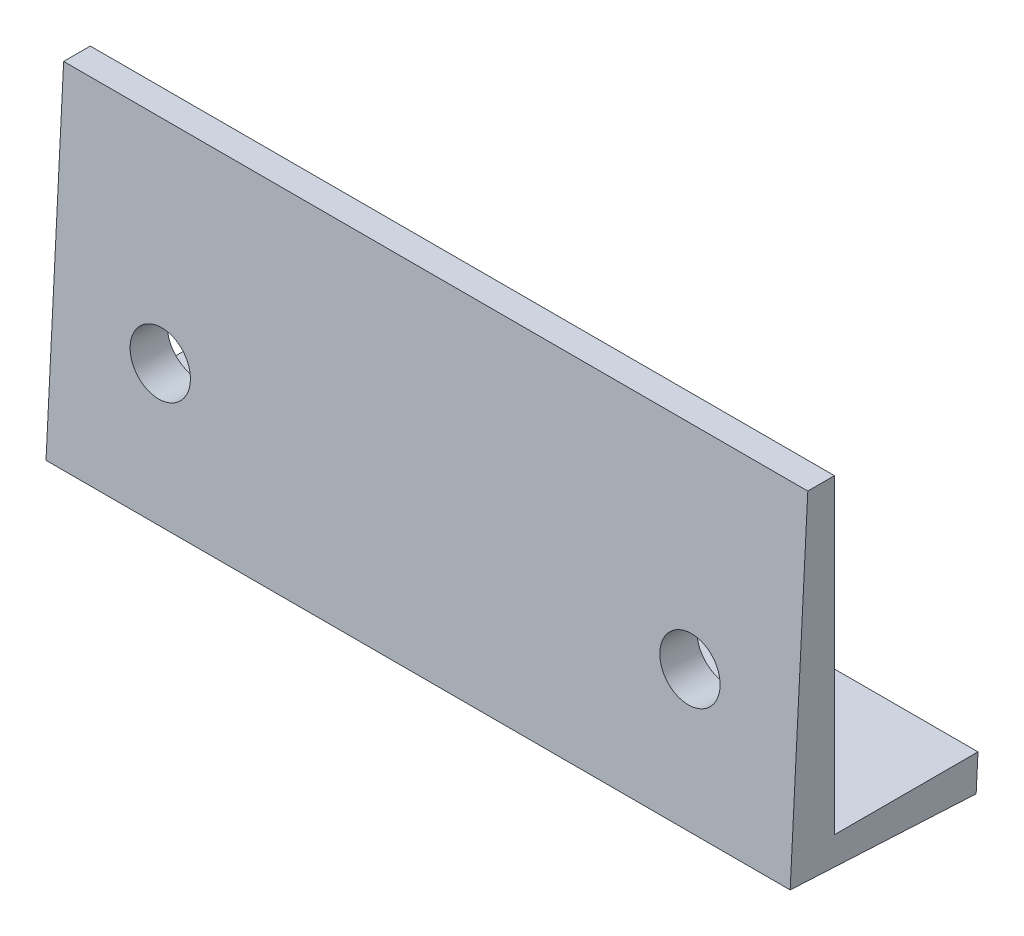
ISO-10303-21;
HEADER;
FILE_DESCRIPTION(('STEP AP214'),'2;1');
FILE_NAME('part.step','',(''),(''),'','','');
FILE_SCHEMA(('AUTOMOTIVE_DESIGN { 1 0 10303 214 1 1 1 1 }'));
ENDSEC;
DATA;
#1=APPLICATION_CONTEXT('core data for automotive mechanical design processes');
#2=APPLICATION_PROTOCOL_DEFINITION('international standard','automotive_design',2000,#1);
#3=PRODUCT_CONTEXT('',#1,'mechanical');
#4=PRODUCT('Part','Part','',(#3));
#5=PRODUCT_RELATED_PRODUCT_CATEGORY('part','',(#4));
#6=PRODUCT_DEFINITION_FORMATION('','',#4);
#7=PRODUCT_DEFINITION_CONTEXT('part definition',#1,'design');
#8=PRODUCT_DEFINITION('design','',#6,#7);
#9=PRODUCT_DEFINITION_SHAPE('','',#8);
#10=(LENGTH_UNIT() NAMED_UNIT(*) SI_UNIT(.MILLI.,.METRE.));
#11=(NAMED_UNIT(*) PLANE_ANGLE_UNIT() SI_UNIT($,.RADIAN.));
#12=(NAMED_UNIT(*) SI_UNIT($,.STERADIAN.) SOLID_ANGLE_UNIT());
#13=UNCERTAINTY_MEASURE_WITH_UNIT(LENGTH_MEASURE(1.E-05),#10,'distance_accuracy_value','');
#14=(GEOMETRIC_REPRESENTATION_CONTEXT(3) GLOBAL_UNCERTAINTY_ASSIGNED_CONTEXT((#13)) GLOBAL_UNIT_ASSIGNED_CONTEXT((#10,
#11,#12)) REPRESENTATION_CONTEXT('',''));
#15=CARTESIAN_POINT('',(0.,0.,0.));
#16=DIRECTION('',(0.,0.,1.));
#17=DIRECTION('',(1.,0.,0.));
#18=AXIS2_PLACEMENT_3D('',#15,#16,#17);
#19=CARTESIAN_POINT('',(42.,-19.,5.));
#20=DIRECTION('',(-1.,0.,0.));
#21=DIRECTION('',(0.,0.,1.));
#22=AXIS2_PLACEMENT_3D('',#19,#20,#21);
#23=PLANE('',#22);
#24=DIRECTION('',(0.,0.0523359562429439,0.998629534754574));
#25=VECTOR('',#24,1.);
#26=CARTESIAN_POINT('',(42.,-19.2616797812147,0.00685232622713093));
#27=LINE('',#26,#25);
#28=CARTESIAN_POINT('',(42.,-20.1002042497434,-15.9931476737729));
#29=VERTEX_POINT('',#28);
#30=CARTESIAN_POINT('',(42.,-19.,5.));
#31=VERTEX_POINT('',#30);
#32=EDGE_CURVE('E110',#29,#31,#27,.T.);
#33=ORIENTED_EDGE('',*,*,#32,.F.);
#34=DIRECTION('',(0.,-0.998629534754574,0.0523359562429444));
#35=VECTOR('',#34,1.);
#36=CARTESIAN_POINT('',(42.,-20.1002042497434,-15.9931476737729));
#37=LINE('',#36,#35);
#38=CARTESIAN_POINT('',(42.,-16.1002042497434,-16.202778790905));
#39=VERTEX_POINT('',#38);
#40=EDGE_CURVE('E100',#39,#29,#37,.T.);
#41=ORIENTED_EDGE('',*,*,#40,.F.);
#42=DIRECTION('',(0.,0.,-1.));
#43=VECTOR('',#42,1.);
#44=CARTESIAN_POINT('',(42.,-16.1002042497434,-16.202778790905));
#45=LINE('',#44,#43);
#46=CARTESIAN_POINT('',(42.,-16.1002042497434,0.));
#47=VERTEX_POINT('',#46);
#48=EDGE_CURVE('E108',#47,#39,#45,.T.);
#49=ORIENTED_EDGE('',*,*,#48,.F.);
#50=DIRECTION('',(0.,1.,0.));
#51=VECTOR('',#50,1.);
#52=CARTESIAN_POINT('',(42.,-19.,0.));
#53=LINE('',#52,#51);
#54=CARTESIAN_POINT('',(42.,19.,0.));
#55=VERTEX_POINT('',#54);
#56=EDGE_CURVE('E66',#47,#55,#53,.T.);
#57=ORIENTED_EDGE('',*,*,#56,.T.);
#58=DIRECTION('',(0.,0.,-1.));
#59=VECTOR('',#58,1.);
#60=CARTESIAN_POINT('',(42.,19.,5.));
#61=LINE('',#60,#59);
#62=CARTESIAN_POINT('',(42.,19.,3.00850438724443));
#63=VERTEX_POINT('',#62);
#64=EDGE_CURVE('E11',#63,#55,#61,.T.);
#65=ORIENTED_EDGE('',*,*,#64,.F.);
#66=DIRECTION('',(0.,0.998629534754574,-0.0523359562429439));
#67=VECTOR('',#66,1.);
#68=CARTESIAN_POINT('',(42.,-19.,5.));
#69=LINE('',#68,#67);
#70=EDGE_CURVE('E70',#31,#63,#69,.T.);
#71=ORIENTED_EDGE('',*,*,#70,.F.);
#72=EDGE_LOOP('',(#33,#41,#49,#57,#65,#71));
#73=FACE_BOUND('',#72,.T.);
#74=ADVANCED_FACE('F39',(#73),#23,.F.);
#75=CARTESIAN_POINT('',(-42.,19.,5.));
#76=DIRECTION('',(0.,-1.,0.));
#77=DIRECTION('',(0.,0.,-1.));
#78=AXIS2_PLACEMENT_3D('',#75,#76,#77);
#79=PLANE('',#78);
#80=DIRECTION('',(0.,0.,-1.));
#81=VECTOR('',#80,1.);
#82=CARTESIAN_POINT('',(-42.,19.,5.));
#83=LINE('',#82,#81);
#84=CARTESIAN_POINT('',(-42.,19.,3.00850438724443));
#85=VERTEX_POINT('',#84);
#86=CARTESIAN_POINT('',(-42.,19.,0.));
#87=VERTEX_POINT('',#86);
#88=EDGE_CURVE('E47',#85,#87,#83,.T.);
#89=ORIENTED_EDGE('',*,*,#88,.F.);
#90=DIRECTION('',(1.,0.,0.));
#91=VECTOR('',#90,1.);
#92=CARTESIAN_POINT('',(-42.,19.,3.00850438724443));
#93=LINE('',#92,#91);
#94=EDGE_CURVE('E73',#85,#63,#93,.T.);
#95=ORIENTED_EDGE('',*,*,#94,.T.);
#96=ORIENTED_EDGE('',*,*,#64,.T.);
#97=DIRECTION('',(-1.,0.,0.));
#98=VECTOR('',#97,1.);
#99=CARTESIAN_POINT('',(-42.,19.,0.));
#100=LINE('',#99,#98);
#101=EDGE_CURVE('E136',#55,#87,#100,.T.);
#102=ORIENTED_EDGE('',*,*,#101,.T.);
#103=EDGE_LOOP('',(#89,#95,#96,#102));
#104=FACE_BOUND('',#103,.T.);
#105=ADVANCED_FACE('F147',(#104),#79,.F.);
#106=CARTESIAN_POINT('',(-42.,-19.,5.));
#107=DIRECTION('',(1.,0.,0.));
#108=DIRECTION('',(0.,0.,-1.));
#109=AXIS2_PLACEMENT_3D('',#106,#107,#108);
#110=PLANE('',#109);
#111=DIRECTION('',(0.,-1.,0.));
#112=VECTOR('',#111,1.);
#113=CARTESIAN_POINT('',(-42.,-19.,0.));
#114=LINE('',#113,#112);
#115=CARTESIAN_POINT('',(-42.,-16.1002042497434,0.));
#116=VERTEX_POINT('',#115);
#117=EDGE_CURVE('E134',#87,#116,#114,.T.);
#118=ORIENTED_EDGE('',*,*,#117,.T.);
#119=DIRECTION('',(0.,0.,-1.));
#120=VECTOR('',#119,1.);
#121=CARTESIAN_POINT('',(-42.,-16.1002042497434,-16.202778790905));
#122=LINE('',#121,#120);
#123=CARTESIAN_POINT('',(-42.,-16.1002042497434,-16.202778790905));
#124=VERTEX_POINT('',#123);
#125=EDGE_CURVE('E117',#116,#124,#122,.T.);
#126=ORIENTED_EDGE('',*,*,#125,.T.);
#127=DIRECTION('',(0.,-0.998629534754574,0.0523359562429444));
#128=VECTOR('',#127,1.);
#129=CARTESIAN_POINT('',(-42.,-20.1002042497434,-15.9931476737729));
#130=LINE('',#129,#128);
#131=CARTESIAN_POINT('',(-42.,-20.1002042497434,-15.9931476737729));
#132=VERTEX_POINT('',#131);
#133=EDGE_CURVE('E102',#124,#132,#130,.T.);
#134=ORIENTED_EDGE('',*,*,#133,.T.);
#135=DIRECTION('',(0.,-0.0523359562429439,-0.998629534754574));
#136=VECTOR('',#135,1.);
#137=CARTESIAN_POINT('',(-42.,-19.2616797812147,0.00685232622713093));
#138=LINE('',#137,#136);
#139=CARTESIAN_POINT('',(-42.,-19.,5.));
#140=VERTEX_POINT('',#139);
#141=EDGE_CURVE('E125',#140,#132,#138,.T.);
#142=ORIENTED_EDGE('',*,*,#141,.F.);
#143=DIRECTION('',(0.,-0.998629534754574,0.0523359562429439));
#144=VECTOR('',#143,1.);
#145=CARTESIAN_POINT('',(-42.,-19.,5.));
#146=LINE('',#145,#144);
#147=EDGE_CURVE('E54',#85,#140,#146,.T.);
#148=ORIENTED_EDGE('',*,*,#147,.F.);
#149=ORIENTED_EDGE('',*,*,#88,.T.);
#150=EDGE_LOOP('',(#118,#126,#134,#142,#148,#149));
#151=FACE_BOUND('',#150,.T.);
#152=ADVANCED_FACE('F142',(#151),#110,.F.);
#153=CARTESIAN_POINT('',(0.,0.,0.));
#154=DIRECTION('',(0.,0.,-1.));
#155=DIRECTION('',(-1.,0.,0.));
#156=AXIS2_PLACEMENT_3D('',#153,#154,#155);
#157=PLANE('',#156);
#158=CARTESIAN_POINT('',(-29.8956518577535,-4.08909575725117,0.));
#159=DIRECTION('',(0.,0.,-1.));
#160=DIRECTION('',(0.,1.,0.));
#161=AXIS2_PLACEMENT_3D('',#158,#159,#160);
#162=ELLIPSE('',#161,3.40466597639305,3.40000000000012);
#163=CARTESIAN_POINT('',(-29.8956518577535,-0.684429780858121,0.));
#164=VERTEX_POINT('',#163);
#165=EDGE_CURVE('E120',#164,#164,#162,.T.);
#166=ORIENTED_EDGE('',*,*,#165,.F.);
#167=EDGE_LOOP('',(#166));
#168=FACE_BOUND('',#167,.T.);
#169=CARTESIAN_POINT('',(29.8956518577535,-4.08909575725117,0.));
#170=DIRECTION('',(0.,0.,-1.));
#171=DIRECTION('',(0.,1.,0.));
#172=AXIS2_PLACEMENT_3D('',#169,#170,#171);
#173=ELLIPSE('',#172,3.40466597639305,3.40000000000012);
#174=CARTESIAN_POINT('',(29.8956518577535,-0.684429780858118,0.));
#175=VERTEX_POINT('',#174);
#176=EDGE_CURVE('E257',#175,#175,#173,.T.);
#177=ORIENTED_EDGE('',*,*,#176,.F.);
#178=EDGE_LOOP('',(#177));
#179=FACE_BOUND('',#178,.T.);
#180=DIRECTION('',(-1.,0.,0.));
#181=VECTOR('',#180,1.);
#182=CARTESIAN_POINT('',(42.,-16.1002042497434,0.));
#183=LINE('',#182,#181);
#184=EDGE_CURVE('E115',#47,#116,#183,.T.);
#185=ORIENTED_EDGE('',*,*,#184,.T.);
#186=ORIENTED_EDGE('',*,*,#117,.F.);
#187=ORIENTED_EDGE('',*,*,#101,.F.);
#188=ORIENTED_EDGE('',*,*,#56,.F.);
#189=EDGE_LOOP('',(#185,#186,#187,#188));
#190=FACE_BOUND('',#189,.T.);
#191=ADVANCED_FACE('F149',(#168,#179,#190),#157,.T.);
#192=CARTESIAN_POINT('',(0.,-0.0260388396630972,4.00561683138406));
#193=DIRECTION('',(0.,-0.0523359562429439,-0.998629534754574));
#194=DIRECTION('',(-1.,0.,0.));
#195=AXIS2_PLACEMENT_3D('',#192,#193,#194);
#196=PLANE('',#195);
#197=CARTESIAN_POINT('',(-29.8956518577535,-3.86861634587975,4.20699778520785));
#198=DIRECTION('',(0.,0.052335956242944,0.998629534754574));
#199=DIRECTION('',(0.,-0.998629534754574,0.052335956242944));
#200=AXIS2_PLACEMENT_3D('',#197,#198,#199);
#201=CIRCLE('',#200,3.40000000000012);
#202=CARTESIAN_POINT('',(-29.8956518577535,-7.26395676404542,4.38494003643387));
#203=VERTEX_POINT('',#202);
#204=EDGE_CURVE('E256',#203,#203,#201,.T.);
#205=ORIENTED_EDGE('',*,*,#204,.F.);
#206=EDGE_LOOP('',(#205));
#207=FACE_BOUND('',#206,.T.);
#208=CARTESIAN_POINT('',(29.8956518577535,-3.86861634587975,4.20699778520785));
#209=DIRECTION('',(0.,0.052335956242944,0.998629534754574));
#210=DIRECTION('',(0.,-0.998629534754574,0.052335956242944));
#211=AXIS2_PLACEMENT_3D('',#208,#209,#210);
#212=CIRCLE('',#211,3.40000000000012);
#213=CARTESIAN_POINT('',(29.8956518577535,-7.26395676404543,4.38494003643387));
#214=VERTEX_POINT('',#213);
#215=EDGE_CURVE('E258',#214,#214,#212,.T.);
#216=ORIENTED_EDGE('',*,*,#215,.F.);
#217=EDGE_LOOP('',(#216));
#218=FACE_BOUND('',#217,.T.);
#219=ORIENTED_EDGE('',*,*,#147,.T.);
#220=DIRECTION('',(1.,0.,0.));
#221=VECTOR('',#220,1.);
#222=CARTESIAN_POINT('',(-42.,-19.,5.));
#223=LINE('',#222,#221);
#224=EDGE_CURVE('E132',#140,#31,#223,.T.);
#225=ORIENTED_EDGE('',*,*,#224,.T.);
#226=ORIENTED_EDGE('',*,*,#70,.T.);
#227=ORIENTED_EDGE('',*,*,#94,.F.);
#228=EDGE_LOOP('',(#219,#225,#226,#227));
#229=FACE_BOUND('',#228,.T.);
#230=ADVANCED_FACE('F151',(#207,#218,#229),#196,.F.);
#231=CARTESIAN_POINT('',(0.,-19.2616797812147,0.00685232622713093));
#232=DIRECTION('',(0.,0.998629534754574,-0.0523359562429439));
#233=DIRECTION('',(0.,0.0523359562429439,0.998629534754574));
#234=AXIS2_PLACEMENT_3D('',#231,#232,#233);
#235=PLANE('',#234);
#236=ORIENTED_EDGE('',*,*,#141,.T.);
#237=DIRECTION('',(-1.,0.,0.));
#238=VECTOR('',#237,1.);
#239=CARTESIAN_POINT('',(42.,-20.1002042497434,-15.9931476737729));
#240=LINE('',#239,#238);
#241=EDGE_CURVE('E106',#29,#132,#240,.T.);
#242=ORIENTED_EDGE('',*,*,#241,.F.);
#243=ORIENTED_EDGE('',*,*,#32,.T.);
#244=ORIENTED_EDGE('',*,*,#224,.F.);
#245=EDGE_LOOP('',(#236,#242,#243,#244));
#246=FACE_BOUND('',#245,.T.);
#247=ADVANCED_FACE('F158',(#246),#235,.F.);
#248=CARTESIAN_POINT('',(42.,-16.1002042497434,-16.202778790905));
#249=DIRECTION('',(0.,1.,0.));
#250=DIRECTION('',(0.,0.,1.));
#251=AXIS2_PLACEMENT_3D('',#248,#249,#250);
#252=PLANE('',#251);
#253=ORIENTED_EDGE('',*,*,#125,.F.);
#254=ORIENTED_EDGE('',*,*,#184,.F.);
#255=ORIENTED_EDGE('',*,*,#48,.T.);
#256=DIRECTION('',(-1.,0.,0.));
#257=VECTOR('',#256,1.);
#258=CARTESIAN_POINT('',(42.,-16.1002042497434,-16.202778790905));
#259=LINE('',#258,#257);
#260=EDGE_CURVE('E96',#39,#124,#259,.T.);
#261=ORIENTED_EDGE('',*,*,#260,.T.);
#262=EDGE_LOOP('',(#253,#254,#255,#261));
#263=FACE_BOUND('',#262,.T.);
#264=ADVANCED_FACE('F113',(#263),#252,.T.);
#265=CARTESIAN_POINT('',(42.,-20.1002042497434,-15.9931476737729));
#266=DIRECTION('',(0.,-0.0523359562429444,-0.998629534754574));
#267=DIRECTION('',(0.,0.998629534754574,-0.0523359562429444));
#268=AXIS2_PLACEMENT_3D('',#265,#266,#267);
#269=PLANE('',#268);
#270=ORIENTED_EDGE('',*,*,#133,.F.);
#271=ORIENTED_EDGE('',*,*,#260,.F.);
#272=ORIENTED_EDGE('',*,*,#40,.T.);
#273=ORIENTED_EDGE('',*,*,#241,.T.);
#274=EDGE_LOOP('',(#270,#271,#272,#273));
#275=FACE_BOUND('',#274,.T.);
#276=ADVANCED_FACE('F98',(#275),#269,.T.);
#277=CARTESIAN_POINT('',(29.8956518577535,-4.39197590830919,-5.77929756233789));
#278=DIRECTION('',(0.,0.052335956242944,0.998629534754574));
#279=DIRECTION('',(0.,-0.998629534754574,0.052335956242944));
#280=AXIS2_PLACEMENT_3D('',#277,#278,#279);
#281=CYLINDRICAL_SURFACE('',#280,3.40000000000012);
#282=ORIENTED_EDGE('',*,*,#176,.T.);
#283=EDGE_LOOP('',(#282));
#284=FACE_BOUND('',#283,.T.);
#285=ORIENTED_EDGE('',*,*,#215,.T.);
#286=EDGE_LOOP('',(#285));
#287=FACE_BOUND('',#286,.T.);
#288=ADVANCED_FACE('F231',(#284,#287),#281,.F.);
#289=CARTESIAN_POINT('',(-29.8956518577535,-4.39197590830919,-5.77929756233789));
#290=DIRECTION('',(0.,0.052335956242944,0.998629534754574));
#291=DIRECTION('',(0.,-0.998629534754574,0.052335956242944));
#292=AXIS2_PLACEMENT_3D('',#289,#290,#291);
#293=CYLINDRICAL_SURFACE('',#292,3.40000000000012);
#294=ORIENTED_EDGE('',*,*,#165,.T.);
#295=EDGE_LOOP('',(#294));
#296=FACE_BOUND('',#295,.T.);
#297=ORIENTED_EDGE('',*,*,#204,.T.);
#298=EDGE_LOOP('',(#297));
#299=FACE_BOUND('',#298,.T.);
#300=ADVANCED_FACE('F239',(#296,#299),#293,.F.);
#301=CLOSED_SHELL('',(#74,#105,#152,#191,#230,#247,#264,#276,#288,#300));
#302=MANIFOLD_SOLID_BREP('B2',#301);
#303=ADVANCED_BREP_SHAPE_REPRESENTATION('',(#18,#302),#14);
#304=SHAPE_DEFINITION_REPRESENTATION(#9,#303);
ENDSEC;
END-ISO-10303-21;
